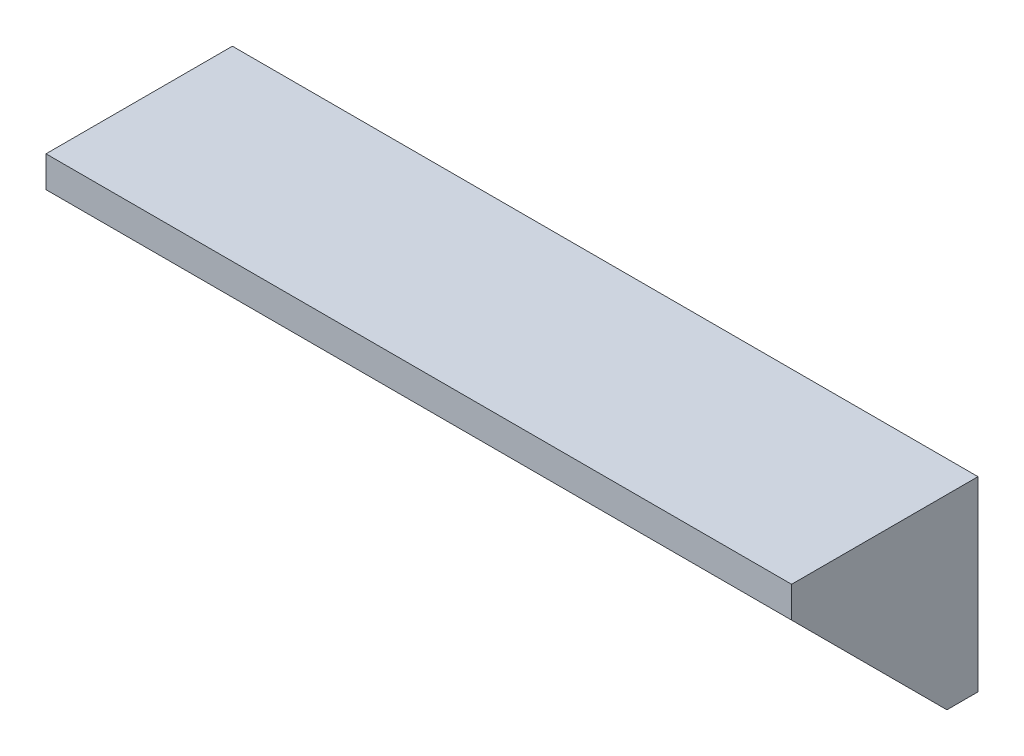
ISO-10303-21;
HEADER;
FILE_DESCRIPTION(('STEP AP214'),'2;1');
FILE_NAME('part.step','',(''),(''),'','','');
FILE_SCHEMA(('AUTOMOTIVE_DESIGN { 1 0 10303 214 1 1 1 1 }'));
ENDSEC;
DATA;
#1=APPLICATION_CONTEXT('core data for automotive mechanical design processes');
#2=APPLICATION_PROTOCOL_DEFINITION('international standard','automotive_design',2000,#1);
#3=PRODUCT_CONTEXT('',#1,'mechanical');
#4=PRODUCT('Part','Part','',(#3));
#5=PRODUCT_RELATED_PRODUCT_CATEGORY('part','',(#4));
#6=PRODUCT_DEFINITION_FORMATION('','',#4);
#7=PRODUCT_DEFINITION_CONTEXT('part definition',#1,'design');
#8=PRODUCT_DEFINITION('design','',#6,#7);
#9=PRODUCT_DEFINITION_SHAPE('','',#8);
#10=(LENGTH_UNIT() NAMED_UNIT(*) SI_UNIT(.MILLI.,.METRE.));
#11=(NAMED_UNIT(*) PLANE_ANGLE_UNIT() SI_UNIT($,.RADIAN.));
#12=(NAMED_UNIT(*) SI_UNIT($,.STERADIAN.) SOLID_ANGLE_UNIT());
#13=UNCERTAINTY_MEASURE_WITH_UNIT(LENGTH_MEASURE(1.E-05),#10,'distance_accuracy_value','');
#14=(GEOMETRIC_REPRESENTATION_CONTEXT(3) GLOBAL_UNCERTAINTY_ASSIGNED_CONTEXT((#13)) GLOBAL_UNIT_ASSIGNED_CONTEXT((#10,
#11,#12)) REPRESENTATION_CONTEXT('',''));
#15=CARTESIAN_POINT('',(0.,0.,0.));
#16=DIRECTION('',(0.,0.,1.));
#17=DIRECTION('',(1.,0.,0.));
#18=AXIS2_PLACEMENT_3D('',#15,#16,#17);
#19=CARTESIAN_POINT('',(60.,15.,-30.));
#20=DIRECTION('',(1.,0.,0.));
#21=DIRECTION('',(0.,0.,-1.));
#22=AXIS2_PLACEMENT_3D('',#19,#20,#21);
#23=PLANE('',#22);
#24=DIRECTION('',(0.,1.,0.));
#25=VECTOR('',#24,1.);
#26=CARTESIAN_POINT('',(60.,15.,0.));
#27=LINE('',#26,#25);
#28=CARTESIAN_POINT('',(60.,9.99999999999999,0.));
#29=VERTEX_POINT('',#28);
#30=CARTESIAN_POINT('',(60.,15.,0.));
#31=VERTEX_POINT('',#30);
#32=EDGE_CURVE('E121',#29,#31,#27,.T.);
#33=ORIENTED_EDGE('',*,*,#32,.F.);
#34=DIRECTION('',(0.,0.707106781186546,0.707106781186549));
#35=VECTOR('',#34,1.);
#36=CARTESIAN_POINT('',(60.,-2.50000000000001,-12.5));
#37=LINE('',#36,#35);
#38=CARTESIAN_POINT('',(60.,-15.,-25.0000000000001));
#39=VERTEX_POINT('',#38);
#40=EDGE_CURVE('E66',#29,#39,#37,.F.);
#41=ORIENTED_EDGE('',*,*,#40,.T.);
#42=DIRECTION('',(0.,0.,1.));
#43=VECTOR('',#42,1.);
#44=CARTESIAN_POINT('',(60.,-15.,-30.));
#45=LINE('',#44,#43);
#46=CARTESIAN_POINT('',(60.,-15.,-30.));
#47=VERTEX_POINT('',#46);
#48=EDGE_CURVE('E110',#47,#39,#45,.T.);
#49=ORIENTED_EDGE('',*,*,#48,.F.);
#50=DIRECTION('',(0.,1.,0.));
#51=VECTOR('',#50,1.);
#52=CARTESIAN_POINT('',(60.,15.,-30.));
#53=LINE('',#52,#51);
#54=CARTESIAN_POINT('',(60.,15.,-30.));
#55=VERTEX_POINT('',#54);
#56=EDGE_CURVE('E105',#47,#55,#53,.T.);
#57=ORIENTED_EDGE('',*,*,#56,.T.);
#58=DIRECTION('',(0.,0.,1.));
#59=VECTOR('',#58,1.);
#60=CARTESIAN_POINT('',(60.,15.,-30.));
#61=LINE('',#60,#59);
#62=EDGE_CURVE('E90',#55,#31,#61,.T.);
#63=ORIENTED_EDGE('',*,*,#62,.T.);
#64=EDGE_LOOP('',(#33,#41,#49,#57,#63));
#65=FACE_BOUND('',#64,.T.);
#66=ADVANCED_FACE('F41',(#65),#23,.T.);
#67=CARTESIAN_POINT('',(-60.,-15.,-30.));
#68=DIRECTION('',(0.,-1.,0.));
#69=DIRECTION('',(0.,0.,-1.));
#70=AXIS2_PLACEMENT_3D('',#67,#68,#69);
#71=PLANE('',#70);
#72=ORIENTED_EDGE('',*,*,#48,.T.);
#73=DIRECTION('',(-1.,0.,0.));
#74=VECTOR('',#73,1.);
#75=CARTESIAN_POINT('',(-60.,-15.,-25.0000000000001));
#76=LINE('',#75,#74);
#77=CARTESIAN_POINT('',(-60.,-15.,-25.0000000000001));
#78=VERTEX_POINT('',#77);
#79=EDGE_CURVE('E51',#39,#78,#76,.T.);
#80=ORIENTED_EDGE('',*,*,#79,.T.);
#81=DIRECTION('',(0.,0.,1.));
#82=VECTOR('',#81,1.);
#83=CARTESIAN_POINT('',(-60.,-15.,-30.));
#84=LINE('',#83,#82);
#85=CARTESIAN_POINT('',(-60.,-15.,-30.));
#86=VERTEX_POINT('',#85);
#87=EDGE_CURVE('E126',#86,#78,#84,.T.);
#88=ORIENTED_EDGE('',*,*,#87,.F.);
#89=DIRECTION('',(1.,0.,0.));
#90=VECTOR('',#89,1.);
#91=CARTESIAN_POINT('',(-60.,-15.,-30.));
#92=LINE('',#91,#90);
#93=EDGE_CURVE('E98',#86,#47,#92,.T.);
#94=ORIENTED_EDGE('',*,*,#93,.T.);
#95=EDGE_LOOP('',(#72,#80,#88,#94));
#96=FACE_BOUND('',#95,.T.);
#97=ADVANCED_FACE('F179',(#96),#71,.T.);
#98=CARTESIAN_POINT('',(-60.,15.,-30.));
#99=DIRECTION('',(-1.,0.,0.));
#100=DIRECTION('',(0.,0.,1.));
#101=AXIS2_PLACEMENT_3D('',#98,#99,#100);
#102=PLANE('',#101);
#103=ORIENTED_EDGE('',*,*,#87,.T.);
#104=DIRECTION('',(0.,-0.707106781186546,-0.707106781186549));
#105=VECTOR('',#104,1.);
#106=CARTESIAN_POINT('',(-60.,-2.50000000000001,-12.5));
#107=LINE('',#106,#105);
#108=CARTESIAN_POINT('',(-60.,9.99999999999999,0.));
#109=VERTEX_POINT('',#108);
#110=EDGE_CURVE('E11',#78,#109,#107,.F.);
#111=ORIENTED_EDGE('',*,*,#110,.T.);
#112=DIRECTION('',(0.,-1.,0.));
#113=VECTOR('',#112,1.);
#114=CARTESIAN_POINT('',(-60.,15.,0.));
#115=LINE('',#114,#113);
#116=CARTESIAN_POINT('',(-60.,15.,0.));
#117=VERTEX_POINT('',#116);
#118=EDGE_CURVE('E111',#117,#109,#115,.T.);
#119=ORIENTED_EDGE('',*,*,#118,.F.);
#120=DIRECTION('',(0.,0.,1.));
#121=VECTOR('',#120,1.);
#122=CARTESIAN_POINT('',(-60.,15.,-30.));
#123=LINE('',#122,#121);
#124=CARTESIAN_POINT('',(-60.,15.,-30.));
#125=VERTEX_POINT('',#124);
#126=EDGE_CURVE('E97',#125,#117,#123,.T.);
#127=ORIENTED_EDGE('',*,*,#126,.F.);
#128=DIRECTION('',(0.,-1.,0.));
#129=VECTOR('',#128,1.);
#130=CARTESIAN_POINT('',(-60.,15.,-30.));
#131=LINE('',#130,#129);
#132=EDGE_CURVE('E108',#125,#86,#131,.T.);
#133=ORIENTED_EDGE('',*,*,#132,.T.);
#134=EDGE_LOOP('',(#103,#111,#119,#127,#133));
#135=FACE_BOUND('',#134,.T.);
#136=ADVANCED_FACE('F183',(#135),#102,.T.);
#137=CARTESIAN_POINT('',(-60.,15.,-30.));
#138=DIRECTION('',(0.,1.,0.));
#139=DIRECTION('',(0.,0.,1.));
#140=AXIS2_PLACEMENT_3D('',#137,#138,#139);
#141=PLANE('',#140);
#142=DIRECTION('',(-1.,0.,0.));
#143=VECTOR('',#142,1.);
#144=CARTESIAN_POINT('',(-60.,15.,0.));
#145=LINE('',#144,#143);
#146=EDGE_CURVE('E95',#31,#117,#145,.T.);
#147=ORIENTED_EDGE('',*,*,#146,.F.);
#148=ORIENTED_EDGE('',*,*,#62,.F.);
#149=DIRECTION('',(-1.,0.,0.));
#150=VECTOR('',#149,1.);
#151=CARTESIAN_POINT('',(-60.,15.,-30.));
#152=LINE('',#151,#150);
#153=EDGE_CURVE('E93',#55,#125,#152,.T.);
#154=ORIENTED_EDGE('',*,*,#153,.T.);
#155=ORIENTED_EDGE('',*,*,#126,.T.);
#156=EDGE_LOOP('',(#147,#148,#154,#155));
#157=FACE_BOUND('',#156,.T.);
#158=ADVANCED_FACE('F92',(#157),#141,.T.);
#159=CARTESIAN_POINT('',(0.,0.,-30.));
#160=DIRECTION('',(0.,0.,1.));
#161=DIRECTION('',(1.,0.,0.));
#162=AXIS2_PLACEMENT_3D('',#159,#160,#161);
#163=PLANE('',#162);
#164=CARTESIAN_POINT('',(40.,0.,-30.));
#165=DIRECTION('',(0.,0.,1.));
#166=DIRECTION('',(1.,0.,0.));
#167=AXIS2_PLACEMENT_3D('',#164,#165,#166);
#168=CIRCLE('',#167,1.7);
#169=CARTESIAN_POINT('',(41.7,0.,-30.));
#170=VERTEX_POINT('',#169);
#171=EDGE_CURVE('E144',#170,#170,#168,.T.);
#172=ORIENTED_EDGE('',*,*,#171,.T.);
#173=EDGE_LOOP('',(#172));
#174=FACE_BOUND('',#173,.T.);
#175=CARTESIAN_POINT('',(-40.,0.,-30.));
#176=DIRECTION('',(0.,0.,1.));
#177=DIRECTION('',(1.,0.,0.));
#178=AXIS2_PLACEMENT_3D('',#175,#176,#177);
#179=CIRCLE('',#178,1.7);
#180=CARTESIAN_POINT('',(-38.3,0.,-30.));
#181=VERTEX_POINT('',#180);
#182=EDGE_CURVE('E116',#181,#181,#179,.T.);
#183=ORIENTED_EDGE('',*,*,#182,.T.);
#184=EDGE_LOOP('',(#183));
#185=FACE_BOUND('',#184,.T.);
#186=ORIENTED_EDGE('',*,*,#56,.F.);
#187=ORIENTED_EDGE('',*,*,#93,.F.);
#188=ORIENTED_EDGE('',*,*,#132,.F.);
#189=ORIENTED_EDGE('',*,*,#153,.F.);
#190=EDGE_LOOP('',(#186,#187,#188,#189));
#191=FACE_BOUND('',#190,.T.);
#192=ADVANCED_FACE('F103',(#174,#185,#191),#163,.F.);
#193=CARTESIAN_POINT('',(0.,0.,0.));
#194=DIRECTION('',(0.,0.,1.));
#195=DIRECTION('',(1.,0.,0.));
#196=AXIS2_PLACEMENT_3D('',#193,#194,#195);
#197=PLANE('',#196);
#198=ORIENTED_EDGE('',*,*,#118,.T.);
#199=DIRECTION('',(1.,0.,0.));
#200=VECTOR('',#199,1.);
#201=CARTESIAN_POINT('',(0.,9.99999999999999,0.));
#202=LINE('',#201,#200);
#203=EDGE_CURVE('E125',#109,#29,#202,.T.);
#204=ORIENTED_EDGE('',*,*,#203,.T.);
#205=ORIENTED_EDGE('',*,*,#32,.T.);
#206=ORIENTED_EDGE('',*,*,#146,.T.);
#207=EDGE_LOOP('',(#198,#204,#205,#206));
#208=FACE_BOUND('',#207,.T.);
#209=ADVANCED_FACE('F174',(#208),#197,.T.);
#210=CARTESIAN_POINT('',(-40.,0.,-30.));
#211=DIRECTION('',(0.,0.,1.));
#212=DIRECTION('',(1.,0.,0.));
#213=AXIS2_PLACEMENT_3D('',#210,#211,#212);
#214=CYLINDRICAL_SURFACE('',#213,1.7);
#215=CARTESIAN_POINT('',(-40.,0.,-25.));
#216=DIRECTION('',(0.,0.,-1.));
#217=DIRECTION('',(-1.,0.,0.));
#218=AXIS2_PLACEMENT_3D('',#215,#216,#217);
#219=CIRCLE('',#218,1.7);
#220=CARTESIAN_POINT('',(-41.7,0.,-25.));
#221=VERTEX_POINT('',#220);
#222=EDGE_CURVE('E132',#221,#221,#219,.F.);
#223=ORIENTED_EDGE('',*,*,#222,.T.);
#224=EDGE_LOOP('',(#223));
#225=FACE_BOUND('',#224,.T.);
#226=ORIENTED_EDGE('',*,*,#182,.F.);
#227=EDGE_LOOP('',(#226));
#228=FACE_BOUND('',#227,.T.);
#229=ADVANCED_FACE('F169',(#225,#228),#214,.F.);
#230=CARTESIAN_POINT('',(40.,0.,-30.));
#231=DIRECTION('',(0.,0.,1.));
#232=DIRECTION('',(1.,0.,0.));
#233=AXIS2_PLACEMENT_3D('',#230,#231,#232);
#234=CYLINDRICAL_SURFACE('',#233,1.7);
#235=CARTESIAN_POINT('',(40.,0.,-25.));
#236=DIRECTION('',(0.,0.,-1.));
#237=DIRECTION('',(-1.,0.,0.));
#238=AXIS2_PLACEMENT_3D('',#235,#236,#237);
#239=CIRCLE('',#238,1.7);
#240=CARTESIAN_POINT('',(38.3,0.,-25.));
#241=VERTEX_POINT('',#240);
#242=EDGE_CURVE('E129',#241,#241,#239,.F.);
#243=ORIENTED_EDGE('',*,*,#242,.T.);
#244=EDGE_LOOP('',(#243));
#245=FACE_BOUND('',#244,.T.);
#246=ORIENTED_EDGE('',*,*,#171,.F.);
#247=EDGE_LOOP('',(#246));
#248=FACE_BOUND('',#247,.T.);
#249=ADVANCED_FACE('F163',(#245,#248),#234,.F.);
#250=CARTESIAN_POINT('',(40.,0.,-25.));
#251=DIRECTION('',(0.,0.,-1.));
#252=DIRECTION('',(-1.,0.,0.));
#253=AXIS2_PLACEMENT_3D('',#250,#251,#252);
#254=PLANE('',#253);
#255=CARTESIAN_POINT('',(40.,0.,-25.));
#256=DIRECTION('',(0.,0.,-1.));
#257=DIRECTION('',(-1.,0.,0.));
#258=AXIS2_PLACEMENT_3D('',#255,#256,#257);
#259=CIRCLE('',#258,3.);
#260=CARTESIAN_POINT('',(37.,0.,-25.));
#261=VERTEX_POINT('',#260);
#262=EDGE_CURVE('E133',#261,#261,#259,.T.);
#263=ORIENTED_EDGE('',*,*,#262,.F.);
#264=EDGE_LOOP('',(#263));
#265=FACE_BOUND('',#264,.T.);
#266=ORIENTED_EDGE('',*,*,#242,.F.);
#267=EDGE_LOOP('',(#266));
#268=FACE_BOUND('',#267,.T.);
#269=ADVANCED_FACE('F160',(#265,#268),#254,.F.);
#270=CARTESIAN_POINT('',(40.,0.,5.));
#271=DIRECTION('',(0.,0.,-1.));
#272=DIRECTION('',(-1.,0.,0.));
#273=AXIS2_PLACEMENT_3D('',#270,#271,#272);
#274=CYLINDRICAL_SURFACE('',#273,3.);
#275=CARTESIAN_POINT('',(40.,0.,-10.));
#276=DIRECTION('',(0.,0.707106781186549,-0.707106781186546));
#277=DIRECTION('',(0.,-0.707106781186546,-0.707106781186549));
#278=AXIS2_PLACEMENT_3D('',#275,#276,#277);
#279=ELLIPSE('',#278,4.24264068711929,3.);
#280=CARTESIAN_POINT('',(40.,-3.,-13.));
#281=VERTEX_POINT('',#280);
#282=EDGE_CURVE('E46',#281,#281,#279,.F.);
#283=ORIENTED_EDGE('',*,*,#282,.T.);
#284=EDGE_LOOP('',(#283));
#285=FACE_BOUND('',#284,.T.);
#286=ORIENTED_EDGE('',*,*,#262,.T.);
#287=EDGE_LOOP('',(#286));
#288=FACE_BOUND('',#287,.T.);
#289=ADVANCED_FACE('F158',(#285,#288),#274,.F.);
#290=CARTESIAN_POINT('',(-40.,0.,-25.));
#291=DIRECTION('',(0.,0.,-1.));
#292=DIRECTION('',(-1.,0.,0.));
#293=AXIS2_PLACEMENT_3D('',#290,#291,#292);
#294=PLANE('',#293);
#295=CARTESIAN_POINT('',(-40.,0.,-25.));
#296=DIRECTION('',(0.,0.,-1.));
#297=DIRECTION('',(-1.,0.,0.));
#298=AXIS2_PLACEMENT_3D('',#295,#296,#297);
#299=CIRCLE('',#298,3.);
#300=CARTESIAN_POINT('',(-43.,0.,-25.));
#301=VERTEX_POINT('',#300);
#302=EDGE_CURVE('E152',#301,#301,#299,.T.);
#303=ORIENTED_EDGE('',*,*,#302,.F.);
#304=EDGE_LOOP('',(#303));
#305=FACE_BOUND('',#304,.T.);
#306=ORIENTED_EDGE('',*,*,#222,.F.);
#307=EDGE_LOOP('',(#306));
#308=FACE_BOUND('',#307,.T.);
#309=ADVANCED_FACE('F233',(#305,#308),#294,.F.);
#310=CARTESIAN_POINT('',(-40.,0.,5.));
#311=DIRECTION('',(0.,0.,-1.));
#312=DIRECTION('',(-1.,0.,0.));
#313=AXIS2_PLACEMENT_3D('',#310,#311,#312);
#314=CYLINDRICAL_SURFACE('',#313,3.);
#315=CARTESIAN_POINT('',(-40.,0.,-10.));
#316=DIRECTION('',(0.,0.707106781186549,-0.707106781186546));
#317=DIRECTION('',(0.,-0.707106781186546,-0.707106781186549));
#318=AXIS2_PLACEMENT_3D('',#315,#316,#317);
#319=ELLIPSE('',#318,4.24264068711929,3.);
#320=CARTESIAN_POINT('',(-40.,-3.,-13.));
#321=VERTEX_POINT('',#320);
#322=EDGE_CURVE('E136',#321,#321,#319,.F.);
#323=ORIENTED_EDGE('',*,*,#322,.T.);
#324=EDGE_LOOP('',(#323));
#325=FACE_BOUND('',#324,.T.);
#326=ORIENTED_EDGE('',*,*,#302,.T.);
#327=EDGE_LOOP('',(#326));
#328=FACE_BOUND('',#327,.T.);
#329=ADVANCED_FACE('F237',(#325,#328),#314,.F.);
#330=CARTESIAN_POINT('',(0.,9.99999999999999,0.));
#331=DIRECTION('',(0.,0.707106781186549,-0.707106781186546));
#332=DIRECTION('',(1.,0.,0.));
#333=AXIS2_PLACEMENT_3D('',#330,#331,#332);
#334=PLANE('',#333);
#335=ORIENTED_EDGE('',*,*,#110,.F.);
#336=ORIENTED_EDGE('',*,*,#79,.F.);
#337=ORIENTED_EDGE('',*,*,#40,.F.);
#338=ORIENTED_EDGE('',*,*,#203,.F.);
#339=EDGE_LOOP('',(#335,#336,#337,#338));
#340=FACE_BOUND('',#339,.T.);
#341=ORIENTED_EDGE('',*,*,#322,.F.);
#342=EDGE_LOOP('',(#341));
#343=FACE_BOUND('',#342,.T.);
#344=ORIENTED_EDGE('',*,*,#282,.F.);
#345=EDGE_LOOP('',(#344));
#346=FACE_BOUND('',#345,.T.);
#347=ADVANCED_FACE('F44',(#340,#343,#346),#334,.F.);
#348=CLOSED_SHELL('',(#66,#97,#136,#158,#192,#209,#229,#249,#269,#289,#309,#329,#347));
#349=MANIFOLD_SOLID_BREP('B2',#348);
#350=ADVANCED_BREP_SHAPE_REPRESENTATION('',(#18,#349),#14);
#351=SHAPE_DEFINITION_REPRESENTATION(#9,#350);
ENDSEC;
END-ISO-10303-21;
